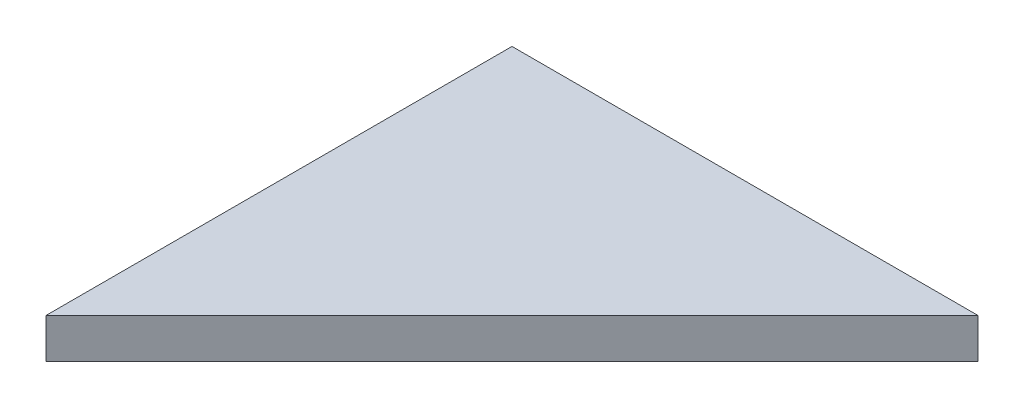
ISO-10303-21;
HEADER;
FILE_DESCRIPTION(('STEP AP214'),'2;1');
FILE_NAME('part.step','',(''),(''),'','','');
FILE_SCHEMA(('AUTOMOTIVE_DESIGN { 1 0 10303 214 1 1 1 1 }'));
ENDSEC;
DATA;
#1=APPLICATION_CONTEXT('core data for automotive mechanical design processes');
#2=APPLICATION_PROTOCOL_DEFINITION('international standard','automotive_design',2000,#1);
#3=PRODUCT_CONTEXT('',#1,'mechanical');
#4=PRODUCT('Part','Part','',(#3));
#5=PRODUCT_RELATED_PRODUCT_CATEGORY('part','',(#4));
#6=PRODUCT_DEFINITION_FORMATION('','',#4);
#7=PRODUCT_DEFINITION_CONTEXT('part definition',#1,'design');
#8=PRODUCT_DEFINITION('design','',#6,#7);
#9=PRODUCT_DEFINITION_SHAPE('','',#8);
#10=(LENGTH_UNIT() NAMED_UNIT(*) SI_UNIT(.MILLI.,.METRE.));
#11=(NAMED_UNIT(*) PLANE_ANGLE_UNIT() SI_UNIT($,.RADIAN.));
#12=(NAMED_UNIT(*) SI_UNIT($,.STERADIAN.) SOLID_ANGLE_UNIT());
#13=UNCERTAINTY_MEASURE_WITH_UNIT(LENGTH_MEASURE(1.E-05),#10,'distance_accuracy_value','');
#14=(GEOMETRIC_REPRESENTATION_CONTEXT(3) GLOBAL_UNCERTAINTY_ASSIGNED_CONTEXT((#13)) GLOBAL_UNIT_ASSIGNED_CONTEXT((#10,
#11,#12)) REPRESENTATION_CONTEXT('',''));
#15=CARTESIAN_POINT('',(0.,0.,0.));
#16=DIRECTION('',(0.,0.,1.));
#17=DIRECTION('',(1.,0.,0.));
#18=AXIS2_PLACEMENT_3D('',#15,#16,#17);
#19=CARTESIAN_POINT('',(0.,6.,70.));
#20=DIRECTION('',(1.,0.,0.));
#21=DIRECTION('',(0.,0.,-1.));
#22=AXIS2_PLACEMENT_3D('',#19,#20,#21);
#23=PLANE('',#22);
#24=DIRECTION('',(0.,0.,1.));
#25=VECTOR('',#24,1.);
#26=CARTESIAN_POINT('',(0.,0.,70.));
#27=LINE('',#26,#25);
#28=CARTESIAN_POINT('',(0.,0.,0.));
#29=VERTEX_POINT('',#28);
#30=CARTESIAN_POINT('',(0.,0.,70.));
#31=VERTEX_POINT('',#30);
#32=EDGE_CURVE('E83',#29,#31,#27,.T.);
#33=ORIENTED_EDGE('',*,*,#32,.T.);
#34=DIRECTION('',(0.,-1.,0.));
#35=VECTOR('',#34,1.);
#36=CARTESIAN_POINT('',(0.,6.,70.));
#37=LINE('',#36,#35);
#38=CARTESIAN_POINT('',(0.,6.,70.));
#39=VERTEX_POINT('',#38);
#40=EDGE_CURVE('E11',#39,#31,#37,.T.);
#41=ORIENTED_EDGE('',*,*,#40,.F.);
#42=DIRECTION('',(0.,0.,1.));
#43=VECTOR('',#42,1.);
#44=CARTESIAN_POINT('',(0.,6.,70.));
#45=LINE('',#44,#43);
#46=CARTESIAN_POINT('',(0.,6.,0.));
#47=VERTEX_POINT('',#46);
#48=EDGE_CURVE('E76',#47,#39,#45,.T.);
#49=ORIENTED_EDGE('',*,*,#48,.F.);
#50=DIRECTION('',(0.,-1.,0.));
#51=VECTOR('',#50,1.);
#52=CARTESIAN_POINT('',(0.,6.,0.));
#53=LINE('',#52,#51);
#54=EDGE_CURVE('E84',#47,#29,#53,.T.);
#55=ORIENTED_EDGE('',*,*,#54,.T.);
#56=EDGE_LOOP('',(#33,#41,#49,#55));
#57=FACE_BOUND('',#56,.T.);
#58=ADVANCED_FACE('F36',(#57),#23,.F.);
#59=CARTESIAN_POINT('',(70.,6.,0.));
#60=DIRECTION('',(-0.707106781186547,0.,-0.707106781186547));
#61=DIRECTION('',(-0.707106781186548,0.,0.707106781186548));
#62=AXIS2_PLACEMENT_3D('',#59,#60,#61);
#63=PLANE('',#62);
#64=DIRECTION('',(0.707106781186548,0.,-0.707106781186548));
#65=VECTOR('',#64,1.);
#66=CARTESIAN_POINT('',(70.,0.,0.));
#67=LINE('',#66,#65);
#68=CARTESIAN_POINT('',(70.,0.,0.));
#69=VERTEX_POINT('',#68);
#70=EDGE_CURVE('E64',#31,#69,#67,.T.);
#71=ORIENTED_EDGE('',*,*,#70,.T.);
#72=DIRECTION('',(0.,-1.,0.));
#73=VECTOR('',#72,1.);
#74=CARTESIAN_POINT('',(70.,6.,0.));
#75=LINE('',#74,#73);
#76=CARTESIAN_POINT('',(70.,6.,0.));
#77=VERTEX_POINT('',#76);
#78=EDGE_CURVE('E44',#77,#69,#75,.T.);
#79=ORIENTED_EDGE('',*,*,#78,.F.);
#80=DIRECTION('',(0.707106781186548,0.,-0.707106781186548));
#81=VECTOR('',#80,1.);
#82=CARTESIAN_POINT('',(70.,6.,0.));
#83=LINE('',#82,#81);
#84=EDGE_CURVE('E72',#39,#77,#83,.T.);
#85=ORIENTED_EDGE('',*,*,#84,.F.);
#86=ORIENTED_EDGE('',*,*,#40,.T.);
#87=EDGE_LOOP('',(#71,#79,#85,#86));
#88=FACE_BOUND('',#87,.T.);
#89=ADVANCED_FACE('F73',(#88),#63,.F.);
#90=CARTESIAN_POINT('',(0.,6.,0.));
#91=DIRECTION('',(0.,0.,1.));
#92=DIRECTION('',(1.,0.,0.));
#93=AXIS2_PLACEMENT_3D('',#90,#91,#92);
#94=PLANE('',#93);
#95=DIRECTION('',(-1.,0.,0.));
#96=VECTOR('',#95,1.);
#97=CARTESIAN_POINT('',(0.,0.,0.));
#98=LINE('',#97,#96);
#99=EDGE_CURVE('E69',#69,#29,#98,.T.);
#100=ORIENTED_EDGE('',*,*,#99,.T.);
#101=ORIENTED_EDGE('',*,*,#54,.F.);
#102=DIRECTION('',(-1.,0.,0.));
#103=VECTOR('',#102,1.);
#104=CARTESIAN_POINT('',(0.,6.,0.));
#105=LINE('',#104,#103);
#106=EDGE_CURVE('E52',#77,#47,#105,.T.);
#107=ORIENTED_EDGE('',*,*,#106,.F.);
#108=ORIENTED_EDGE('',*,*,#78,.T.);
#109=EDGE_LOOP('',(#100,#101,#107,#108));
#110=FACE_BOUND('',#109,.T.);
#111=ADVANCED_FACE('F91',(#110),#94,.F.);
#112=CARTESIAN_POINT('',(0.,6.,0.));
#113=DIRECTION('',(0.,-1.,0.));
#114=DIRECTION('',(0.,0.,-1.));
#115=AXIS2_PLACEMENT_3D('',#112,#113,#114);
#116=PLANE('',#115);
#117=ORIENTED_EDGE('',*,*,#48,.T.);
#118=ORIENTED_EDGE('',*,*,#84,.T.);
#119=ORIENTED_EDGE('',*,*,#106,.T.);
#120=EDGE_LOOP('',(#117,#118,#119));
#121=FACE_BOUND('',#120,.T.);
#122=ADVANCED_FACE('F79',(#121),#116,.F.);
#123=CARTESIAN_POINT('',(0.,0.,0.));
#124=DIRECTION('',(0.,-1.,0.));
#125=DIRECTION('',(0.,0.,-1.));
#126=AXIS2_PLACEMENT_3D('',#123,#124,#125);
#127=PLANE('',#126);
#128=ORIENTED_EDGE('',*,*,#32,.F.);
#129=ORIENTED_EDGE('',*,*,#99,.F.);
#130=ORIENTED_EDGE('',*,*,#70,.F.);
#131=EDGE_LOOP('',(#128,#129,#130));
#132=FACE_BOUND('',#131,.T.);
#133=ADVANCED_FACE('F92',(#132),#127,.T.);
#134=CLOSED_SHELL('',(#58,#89,#111,#122,#133));
#135=MANIFOLD_SOLID_BREP('B2',#134);
#136=ADVANCED_BREP_SHAPE_REPRESENTATION('',(#18,#135),#14);
#137=SHAPE_DEFINITION_REPRESENTATION(#9,#136);
ENDSEC;
END-ISO-10303-21;
